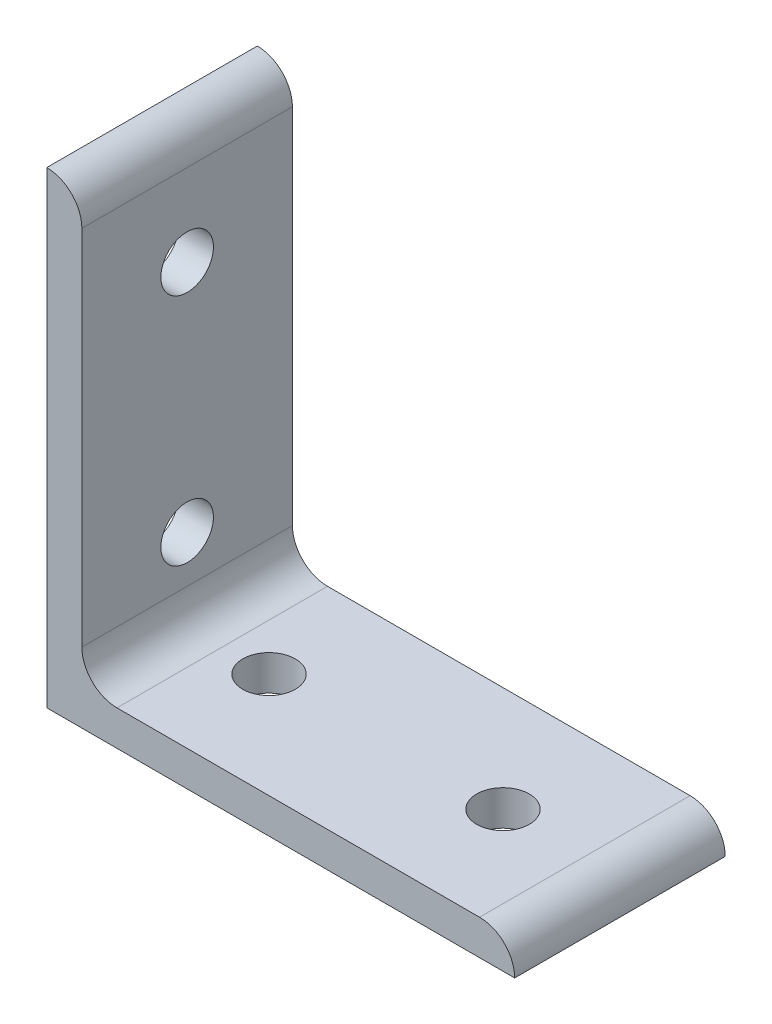
ISO-10303-21;
HEADER;
FILE_DESCRIPTION(('STEP AP214'),'2;1');
FILE_NAME('part.step','',(''),(''),'','','');
FILE_SCHEMA(('AUTOMOTIVE_DESIGN { 1 0 10303 214 1 1 1 1 }'));
ENDSEC;
DATA;
#1=APPLICATION_CONTEXT('core data for automotive mechanical design processes');
#2=APPLICATION_PROTOCOL_DEFINITION('international standard','automotive_design',2000,#1);
#3=PRODUCT_CONTEXT('',#1,'mechanical');
#4=PRODUCT('Part','Part','',(#3));
#5=PRODUCT_RELATED_PRODUCT_CATEGORY('part','',(#4));
#6=PRODUCT_DEFINITION_FORMATION('','',#4);
#7=PRODUCT_DEFINITION_CONTEXT('part definition',#1,'design');
#8=PRODUCT_DEFINITION('design','',#6,#7);
#9=PRODUCT_DEFINITION_SHAPE('','',#8);
#10=(LENGTH_UNIT() NAMED_UNIT(*) SI_UNIT(.MILLI.,.METRE.));
#11=(NAMED_UNIT(*) PLANE_ANGLE_UNIT() SI_UNIT($,.RADIAN.));
#12=(NAMED_UNIT(*) SI_UNIT($,.STERADIAN.) SOLID_ANGLE_UNIT());
#13=UNCERTAINTY_MEASURE_WITH_UNIT(LENGTH_MEASURE(1.E-05),#10,'distance_accuracy_value','');
#14=(GEOMETRIC_REPRESENTATION_CONTEXT(3) GLOBAL_UNCERTAINTY_ASSIGNED_CONTEXT((#13)) GLOBAL_UNIT_ASSIGNED_CONTEXT((#10,
#11,#12)) REPRESENTATION_CONTEXT('',''));
#15=CARTESIAN_POINT('',(0.,0.,0.));
#16=DIRECTION('',(0.,0.,1.));
#17=DIRECTION('',(1.,0.,0.));
#18=AXIS2_PLACEMENT_3D('',#15,#16,#17);
#19=CARTESIAN_POINT('',(5.99999999999999,74.,18.));
#20=DIRECTION('',(-1.,0.,0.));
#21=DIRECTION('',(0.,-1.,0.));
#22=AXIS2_PLACEMENT_3D('',#19,#20,#21);
#23=PLANE('',#22);
#24=CARTESIAN_POINT('',(6.00000000000001,20.,0.));
#25=DIRECTION('',(-1.,0.,0.));
#26=DIRECTION('',(0.,-1.,0.));
#27=AXIS2_PLACEMENT_3D('',#24,#25,#26);
#28=CIRCLE('',#27,4.5);
#29=CARTESIAN_POINT('',(6.00000000000001,15.5,0.));
#30=VERTEX_POINT('',#29);
#31=EDGE_CURVE('E197',#30,#30,#28,.F.);
#32=ORIENTED_EDGE('',*,*,#31,.F.);
#33=EDGE_LOOP('',(#32));
#34=FACE_BOUND('',#33,.T.);
#35=DIRECTION('',(0.,1.,0.));
#36=VECTOR('',#35,1.);
#37=CARTESIAN_POINT('',(5.99999999999999,74.,-18.));
#38=LINE('',#37,#36);
#39=CARTESIAN_POINT('',(6.,12.,-18.));
#40=VERTEX_POINT('',#39);
#41=CARTESIAN_POINT('',(6.00000000000001,74.,-18.));
#42=VERTEX_POINT('',#41);
#43=EDGE_CURVE('E118',#40,#42,#38,.T.);
#44=ORIENTED_EDGE('',*,*,#43,.T.);
#45=DIRECTION('',(0.,0.,-1.));
#46=VECTOR('',#45,1.);
#47=CARTESIAN_POINT('',(6.00000000000001,74.,18.));
#48=LINE('',#47,#46);
#49=CARTESIAN_POINT('',(6.00000000000001,74.,18.));
#50=VERTEX_POINT('',#49);
#51=EDGE_CURVE('E115',#50,#42,#48,.T.);
#52=ORIENTED_EDGE('',*,*,#51,.F.);
#53=DIRECTION('',(0.,1.,0.));
#54=VECTOR('',#53,1.);
#55=CARTESIAN_POINT('',(5.99999999999999,74.,18.));
#56=LINE('',#55,#54);
#57=CARTESIAN_POINT('',(6.,12.,18.));
#58=VERTEX_POINT('',#57);
#59=EDGE_CURVE('E104',#58,#50,#56,.T.);
#60=ORIENTED_EDGE('',*,*,#59,.F.);
#61=DIRECTION('',(0.,0.,-1.));
#62=VECTOR('',#61,1.);
#63=CARTESIAN_POINT('',(6.,12.,18.));
#64=LINE('',#63,#62);
#65=EDGE_CURVE('E119',#58,#40,#64,.T.);
#66=ORIENTED_EDGE('',*,*,#65,.T.);
#67=EDGE_LOOP('',(#44,#52,#60,#66));
#68=FACE_BOUND('',#67,.T.);
#69=CARTESIAN_POINT('',(5.99999999999999,60.,0.));
#70=DIRECTION('',(-1.,0.,0.));
#71=DIRECTION('',(0.,-1.,0.));
#72=AXIS2_PLACEMENT_3D('',#69,#70,#71);
#73=CIRCLE('',#72,4.5);
#74=CARTESIAN_POINT('',(5.99999999999999,55.5,0.));
#75=VERTEX_POINT('',#74);
#76=EDGE_CURVE('E190',#75,#75,#73,.F.);
#77=ORIENTED_EDGE('',*,*,#76,.F.);
#78=EDGE_LOOP('',(#77));
#79=FACE_BOUND('',#78,.T.);
#80=ADVANCED_FACE('F35',(#34,#68,#79),#23,.F.);
#81=CARTESIAN_POINT('',(0.,0.,18.));
#82=DIRECTION('',(1.,0.,0.));
#83=DIRECTION('',(0.,0.,-1.));
#84=AXIS2_PLACEMENT_3D('',#81,#82,#83);
#85=PLANE('',#84);
#86=CARTESIAN_POINT('',(0.,20.,0.));
#87=DIRECTION('',(1.,0.,0.));
#88=DIRECTION('',(0.,0.,-1.));
#89=AXIS2_PLACEMENT_3D('',#86,#87,#88);
#90=CIRCLE('',#89,4.5);
#91=CARTESIAN_POINT('',(0.,20.,-4.5));
#92=VERTEX_POINT('',#91);
#93=EDGE_CURVE('E193',#92,#92,#90,.T.);
#94=ORIENTED_EDGE('',*,*,#93,.T.);
#95=EDGE_LOOP('',(#94));
#96=FACE_BOUND('',#95,.T.);
#97=DIRECTION('',(0.,-1.,0.));
#98=VECTOR('',#97,1.);
#99=CARTESIAN_POINT('',(0.,0.,-18.));
#100=LINE('',#99,#98);
#101=CARTESIAN_POINT('',(0.,80.,-18.));
#102=VERTEX_POINT('',#101);
#103=CARTESIAN_POINT('',(0.,0.,-18.));
#104=VERTEX_POINT('',#103);
#105=EDGE_CURVE('E86',#102,#104,#100,.T.);
#106=ORIENTED_EDGE('',*,*,#105,.T.);
#107=DIRECTION('',(0.,0.,-1.));
#108=VECTOR('',#107,1.);
#109=CARTESIAN_POINT('',(0.,0.,18.));
#110=LINE('',#109,#108);
#111=CARTESIAN_POINT('',(0.,0.,18.));
#112=VERTEX_POINT('',#111);
#113=EDGE_CURVE('E124',#112,#104,#110,.T.);
#114=ORIENTED_EDGE('',*,*,#113,.F.);
#115=DIRECTION('',(0.,-1.,0.));
#116=VECTOR('',#115,1.);
#117=CARTESIAN_POINT('',(0.,0.,18.));
#118=LINE('',#117,#116);
#119=CARTESIAN_POINT('',(0.,80.,18.));
#120=VERTEX_POINT('',#119);
#121=EDGE_CURVE('E54',#120,#112,#118,.T.);
#122=ORIENTED_EDGE('',*,*,#121,.F.);
#123=DIRECTION('',(0.,0.,-1.));
#124=VECTOR('',#123,1.);
#125=CARTESIAN_POINT('',(0.,80.,18.));
#126=LINE('',#125,#124);
#127=EDGE_CURVE('E120',#120,#102,#126,.T.);
#128=ORIENTED_EDGE('',*,*,#127,.T.);
#129=EDGE_LOOP('',(#106,#114,#122,#128));
#130=FACE_BOUND('',#129,.T.);
#131=CARTESIAN_POINT('',(0.,60.,0.));
#132=DIRECTION('',(1.,0.,0.));
#133=DIRECTION('',(0.,0.,-1.));
#134=AXIS2_PLACEMENT_3D('',#131,#132,#133);
#135=CIRCLE('',#134,4.5);
#136=CARTESIAN_POINT('',(0.,60.,-4.5));
#137=VERTEX_POINT('',#136);
#138=EDGE_CURVE('E188',#137,#137,#135,.T.);
#139=ORIENTED_EDGE('',*,*,#138,.T.);
#140=EDGE_LOOP('',(#139));
#141=FACE_BOUND('',#140,.T.);
#142=ADVANCED_FACE('F181',(#96,#130,#141),#85,.F.);
#143=CARTESIAN_POINT('',(80.,0.,18.));
#144=DIRECTION('',(0.,1.,0.));
#145=DIRECTION('',(-1.,0.,0.));
#146=AXIS2_PLACEMENT_3D('',#143,#144,#145);
#147=PLANE('',#146);
#148=CARTESIAN_POINT('',(20.,0.,0.));
#149=DIRECTION('',(0.,1.,0.));
#150=DIRECTION('',(0.,0.,1.));
#151=AXIS2_PLACEMENT_3D('',#148,#149,#150);
#152=CIRCLE('',#151,4.5);
#153=CARTESIAN_POINT('',(20.,0.,4.5));
#154=VERTEX_POINT('',#153);
#155=EDGE_CURVE('E150',#154,#154,#152,.T.);
#156=ORIENTED_EDGE('',*,*,#155,.T.);
#157=EDGE_LOOP('',(#156));
#158=FACE_BOUND('',#157,.T.);
#159=DIRECTION('',(1.,0.,0.));
#160=VECTOR('',#159,1.);
#161=CARTESIAN_POINT('',(80.,0.,-18.));
#162=LINE('',#161,#160);
#163=CARTESIAN_POINT('',(80.,0.,-18.));
#164=VERTEX_POINT('',#163);
#165=EDGE_CURVE('E128',#104,#164,#162,.T.);
#166=ORIENTED_EDGE('',*,*,#165,.T.);
#167=DIRECTION('',(0.,0.,-1.));
#168=VECTOR('',#167,1.);
#169=CARTESIAN_POINT('',(80.,0.,18.));
#170=LINE('',#169,#168);
#171=CARTESIAN_POINT('',(80.,0.,18.));
#172=VERTEX_POINT('',#171);
#173=EDGE_CURVE('E11',#172,#164,#170,.T.);
#174=ORIENTED_EDGE('',*,*,#173,.F.);
#175=DIRECTION('',(1.,0.,0.));
#176=VECTOR('',#175,1.);
#177=CARTESIAN_POINT('',(80.,0.,18.));
#178=LINE('',#177,#176);
#179=EDGE_CURVE('E141',#112,#172,#178,.T.);
#180=ORIENTED_EDGE('',*,*,#179,.F.);
#181=ORIENTED_EDGE('',*,*,#113,.T.);
#182=EDGE_LOOP('',(#166,#174,#180,#181));
#183=FACE_BOUND('',#182,.T.);
#184=CARTESIAN_POINT('',(60.,0.,0.));
#185=DIRECTION('',(0.,1.,0.));
#186=DIRECTION('',(0.,0.,1.));
#187=AXIS2_PLACEMENT_3D('',#184,#185,#186);
#188=CIRCLE('',#187,4.5);
#189=CARTESIAN_POINT('',(60.,0.,4.5));
#190=VERTEX_POINT('',#189);
#191=EDGE_CURVE('E158',#190,#190,#188,.T.);
#192=ORIENTED_EDGE('',*,*,#191,.T.);
#193=EDGE_LOOP('',(#192));
#194=FACE_BOUND('',#193,.T.);
#195=ADVANCED_FACE('F37',(#158,#183,#194),#147,.F.);
#196=CARTESIAN_POINT('',(12.,6.00000000000001,18.));
#197=DIRECTION('',(0.,-1.,0.));
#198=DIRECTION('',(1.,0.,0.));
#199=AXIS2_PLACEMENT_3D('',#196,#197,#198);
#200=PLANE('',#199);
#201=CARTESIAN_POINT('',(20.,6.00000000000001,0.));
#202=DIRECTION('',(0.,-1.,0.));
#203=DIRECTION('',(1.,0.,0.));
#204=AXIS2_PLACEMENT_3D('',#201,#202,#203);
#205=CIRCLE('',#204,4.5);
#206=CARTESIAN_POINT('',(24.5,6.00000000000001,0.));
#207=VERTEX_POINT('',#206);
#208=EDGE_CURVE('E132',#207,#207,#205,.F.);
#209=ORIENTED_EDGE('',*,*,#208,.F.);
#210=EDGE_LOOP('',(#209));
#211=FACE_BOUND('',#210,.T.);
#212=DIRECTION('',(-1.,0.,0.));
#213=VECTOR('',#212,1.);
#214=CARTESIAN_POINT('',(12.,6.00000000000001,-18.));
#215=LINE('',#214,#213);
#216=CARTESIAN_POINT('',(74.,6.,-18.));
#217=VERTEX_POINT('',#216);
#218=CARTESIAN_POINT('',(12.,6.00000000000001,-18.));
#219=VERTEX_POINT('',#218);
#220=EDGE_CURVE('E134',#217,#219,#215,.T.);
#221=ORIENTED_EDGE('',*,*,#220,.T.);
#222=DIRECTION('',(0.,0.,-1.));
#223=VECTOR('',#222,1.);
#224=CARTESIAN_POINT('',(12.,6.00000000000001,18.));
#225=LINE('',#224,#223);
#226=CARTESIAN_POINT('',(12.,6.00000000000001,18.));
#227=VERTEX_POINT('',#226);
#228=EDGE_CURVE('E145',#227,#219,#225,.T.);
#229=ORIENTED_EDGE('',*,*,#228,.F.);
#230=DIRECTION('',(-1.,0.,0.));
#231=VECTOR('',#230,1.);
#232=CARTESIAN_POINT('',(12.,6.00000000000001,18.));
#233=LINE('',#232,#231);
#234=CARTESIAN_POINT('',(74.,6.,18.));
#235=VERTEX_POINT('',#234);
#236=EDGE_CURVE('E164',#235,#227,#233,.T.);
#237=ORIENTED_EDGE('',*,*,#236,.F.);
#238=DIRECTION('',(0.,0.,-1.));
#239=VECTOR('',#238,1.);
#240=CARTESIAN_POINT('',(74.,6.,18.));
#241=LINE('',#240,#239);
#242=EDGE_CURVE('E45',#235,#217,#241,.T.);
#243=ORIENTED_EDGE('',*,*,#242,.T.);
#244=EDGE_LOOP('',(#221,#229,#237,#243));
#245=FACE_BOUND('',#244,.T.);
#246=CARTESIAN_POINT('',(60.,6.00000000000001,0.));
#247=DIRECTION('',(0.,-1.,0.));
#248=DIRECTION('',(1.,0.,0.));
#249=AXIS2_PLACEMENT_3D('',#246,#247,#248);
#250=CIRCLE('',#249,4.5);
#251=CARTESIAN_POINT('',(64.5,6.00000000000001,0.));
#252=VERTEX_POINT('',#251);
#253=EDGE_CURVE('E39',#252,#252,#250,.F.);
#254=ORIENTED_EDGE('',*,*,#253,.F.);
#255=EDGE_LOOP('',(#254));
#256=FACE_BOUND('',#255,.T.);
#257=ADVANCED_FACE('F168',(#211,#245,#256),#200,.F.);
#258=CARTESIAN_POINT('',(74.,0.,18.));
#259=DIRECTION('',(0.,0.,-1.));
#260=DIRECTION('',(-1.,0.,0.));
#261=AXIS2_PLACEMENT_3D('',#258,#259,#260);
#262=CYLINDRICAL_SURFACE('',#261,6.00000000000002);
#263=CARTESIAN_POINT('',(74.,0.,-18.));
#264=DIRECTION('',(0.,0.,1.));
#265=DIRECTION('',(1.,0.,0.));
#266=AXIS2_PLACEMENT_3D('',#263,#264,#265);
#267=CIRCLE('',#266,6.00000000000002);
#268=EDGE_CURVE('E131',#164,#217,#267,.T.);
#269=ORIENTED_EDGE('',*,*,#268,.T.);
#270=ORIENTED_EDGE('',*,*,#242,.F.);
#271=CARTESIAN_POINT('',(74.,0.,18.));
#272=DIRECTION('',(0.,0.,1.));
#273=DIRECTION('',(1.,0.,0.));
#274=AXIS2_PLACEMENT_3D('',#271,#272,#273);
#275=CIRCLE('',#274,6.00000000000002);
#276=EDGE_CURVE('E94',#172,#235,#275,.T.);
#277=ORIENTED_EDGE('',*,*,#276,.F.);
#278=ORIENTED_EDGE('',*,*,#173,.T.);
#279=EDGE_LOOP('',(#269,#270,#277,#278));
#280=FACE_BOUND('',#279,.T.);
#281=ADVANCED_FACE('F212',(#280),#262,.T.);
#282=CARTESIAN_POINT('',(12.,12.,18.));
#283=DIRECTION('',(0.,0.,-1.));
#284=DIRECTION('',(-1.,0.,0.));
#285=AXIS2_PLACEMENT_3D('',#282,#283,#284);
#286=CYLINDRICAL_SURFACE('',#285,6.);
#287=CARTESIAN_POINT('',(12.,12.,-18.));
#288=DIRECTION('',(0.,0.,-1.));
#289=DIRECTION('',(1.,0.,0.));
#290=AXIS2_PLACEMENT_3D('',#287,#288,#289);
#291=CIRCLE('',#290,6.);
#292=EDGE_CURVE('E136',#219,#40,#291,.T.);
#293=ORIENTED_EDGE('',*,*,#292,.T.);
#294=ORIENTED_EDGE('',*,*,#65,.F.);
#295=CARTESIAN_POINT('',(12.,12.,18.));
#296=DIRECTION('',(0.,0.,-1.));
#297=DIRECTION('',(1.,0.,0.));
#298=AXIS2_PLACEMENT_3D('',#295,#296,#297);
#299=CIRCLE('',#298,6.);
#300=EDGE_CURVE('E110',#227,#58,#299,.T.);
#301=ORIENTED_EDGE('',*,*,#300,.F.);
#302=ORIENTED_EDGE('',*,*,#228,.T.);
#303=EDGE_LOOP('',(#293,#294,#301,#302));
#304=FACE_BOUND('',#303,.T.);
#305=ADVANCED_FACE('F173',(#304),#286,.F.);
#306=CARTESIAN_POINT('',(0.,74.,18.));
#307=DIRECTION('',(0.,0.,-1.));
#308=DIRECTION('',(-1.,0.,0.));
#309=AXIS2_PLACEMENT_3D('',#306,#307,#308);
#310=CYLINDRICAL_SURFACE('',#309,6.00000000000002);
#311=CARTESIAN_POINT('',(0.,74.,-18.));
#312=DIRECTION('',(0.,0.,1.));
#313=DIRECTION('',(1.,0.,0.));
#314=AXIS2_PLACEMENT_3D('',#311,#312,#313);
#315=CIRCLE('',#314,6.00000000000002);
#316=EDGE_CURVE('E80',#42,#102,#315,.T.);
#317=ORIENTED_EDGE('',*,*,#316,.T.);
#318=ORIENTED_EDGE('',*,*,#127,.F.);
#319=CARTESIAN_POINT('',(0.,74.,18.));
#320=DIRECTION('',(0.,0.,1.));
#321=DIRECTION('',(1.,0.,0.));
#322=AXIS2_PLACEMENT_3D('',#319,#320,#321);
#323=CIRCLE('',#322,6.00000000000002);
#324=EDGE_CURVE('E108',#50,#120,#323,.T.);
#325=ORIENTED_EDGE('',*,*,#324,.F.);
#326=ORIENTED_EDGE('',*,*,#51,.T.);
#327=EDGE_LOOP('',(#317,#318,#325,#326));
#328=FACE_BOUND('',#327,.T.);
#329=ADVANCED_FACE('F122',(#328),#310,.T.);
#330=CARTESIAN_POINT('',(0.,74.,18.));
#331=DIRECTION('',(0.,0.,1.));
#332=DIRECTION('',(1.,0.,0.));
#333=AXIS2_PLACEMENT_3D('',#330,#331,#332);
#334=PLANE('',#333);
#335=ORIENTED_EDGE('',*,*,#179,.T.);
#336=ORIENTED_EDGE('',*,*,#276,.T.);
#337=ORIENTED_EDGE('',*,*,#236,.T.);
#338=ORIENTED_EDGE('',*,*,#300,.T.);
#339=ORIENTED_EDGE('',*,*,#59,.T.);
#340=ORIENTED_EDGE('',*,*,#324,.T.);
#341=ORIENTED_EDGE('',*,*,#121,.T.);
#342=EDGE_LOOP('',(#335,#336,#337,#338,#339,#340,#341));
#343=FACE_BOUND('',#342,.T.);
#344=ADVANCED_FACE('F106',(#343),#334,.T.);
#345=CARTESIAN_POINT('',(0.,74.,-18.));
#346=DIRECTION('',(0.,0.,1.));
#347=DIRECTION('',(1.,0.,0.));
#348=AXIS2_PLACEMENT_3D('',#345,#346,#347);
#349=PLANE('',#348);
#350=ORIENTED_EDGE('',*,*,#165,.F.);
#351=ORIENTED_EDGE('',*,*,#105,.F.);
#352=ORIENTED_EDGE('',*,*,#316,.F.);
#353=ORIENTED_EDGE('',*,*,#43,.F.);
#354=ORIENTED_EDGE('',*,*,#292,.F.);
#355=ORIENTED_EDGE('',*,*,#220,.F.);
#356=ORIENTED_EDGE('',*,*,#268,.F.);
#357=EDGE_LOOP('',(#350,#351,#352,#353,#354,#355,#356));
#358=FACE_BOUND('',#357,.T.);
#359=ADVANCED_FACE('F176',(#358),#349,.F.);
#360=CARTESIAN_POINT('',(20.,80.,0.));
#361=DIRECTION('',(0.,-1.,0.));
#362=DIRECTION('',(0.,0.,-1.));
#363=AXIS2_PLACEMENT_3D('',#360,#361,#362);
#364=CYLINDRICAL_SURFACE('',#363,4.5);
#365=ORIENTED_EDGE('',*,*,#155,.F.);
#366=EDGE_LOOP('',(#365));
#367=FACE_BOUND('',#366,.T.);
#368=ORIENTED_EDGE('',*,*,#208,.T.);
#369=EDGE_LOOP('',(#368));
#370=FACE_BOUND('',#369,.T.);
#371=ADVANCED_FACE('F208',(#367,#370),#364,.F.);
#372=CARTESIAN_POINT('',(60.,80.,0.));
#373=DIRECTION('',(0.,-1.,0.));
#374=DIRECTION('',(0.,0.,-1.));
#375=AXIS2_PLACEMENT_3D('',#372,#373,#374);
#376=CYLINDRICAL_SURFACE('',#375,4.5);
#377=ORIENTED_EDGE('',*,*,#191,.F.);
#378=EDGE_LOOP('',(#377));
#379=FACE_BOUND('',#378,.T.);
#380=ORIENTED_EDGE('',*,*,#253,.T.);
#381=EDGE_LOOP('',(#380));
#382=FACE_BOUND('',#381,.T.);
#383=ADVANCED_FACE('F204',(#379,#382),#376,.F.);
#384=CARTESIAN_POINT('',(80.,20.,0.));
#385=DIRECTION('',(-1.,0.,0.));
#386=DIRECTION('',(0.,0.,1.));
#387=AXIS2_PLACEMENT_3D('',#384,#385,#386);
#388=CYLINDRICAL_SURFACE('',#387,4.5);
#389=ORIENTED_EDGE('',*,*,#93,.F.);
#390=EDGE_LOOP('',(#389));
#391=FACE_BOUND('',#390,.T.);
#392=ORIENTED_EDGE('',*,*,#31,.T.);
#393=EDGE_LOOP('',(#392));
#394=FACE_BOUND('',#393,.T.);
#395=ADVANCED_FACE('F207',(#391,#394),#388,.F.);
#396=CARTESIAN_POINT('',(80.,60.,0.));
#397=DIRECTION('',(-1.,0.,0.));
#398=DIRECTION('',(0.,0.,1.));
#399=AXIS2_PLACEMENT_3D('',#396,#397,#398);
#400=CYLINDRICAL_SURFACE('',#399,4.5);
#401=ORIENTED_EDGE('',*,*,#138,.F.);
#402=EDGE_LOOP('',(#401));
#403=FACE_BOUND('',#402,.T.);
#404=ORIENTED_EDGE('',*,*,#76,.T.);
#405=EDGE_LOOP('',(#404));
#406=FACE_BOUND('',#405,.T.);
#407=ADVANCED_FACE('F244',(#403,#406),#400,.F.);
#408=CLOSED_SHELL('',(#80,#142,#195,#257,#281,#305,#329,#344,#359,#371,#383,#395,#407));
#409=MANIFOLD_SOLID_BREP('B2',#408);
#410=ADVANCED_BREP_SHAPE_REPRESENTATION('',(#18,#409),#14);
#411=SHAPE_DEFINITION_REPRESENTATION(#9,#410);
ENDSEC;
END-ISO-10303-21;
